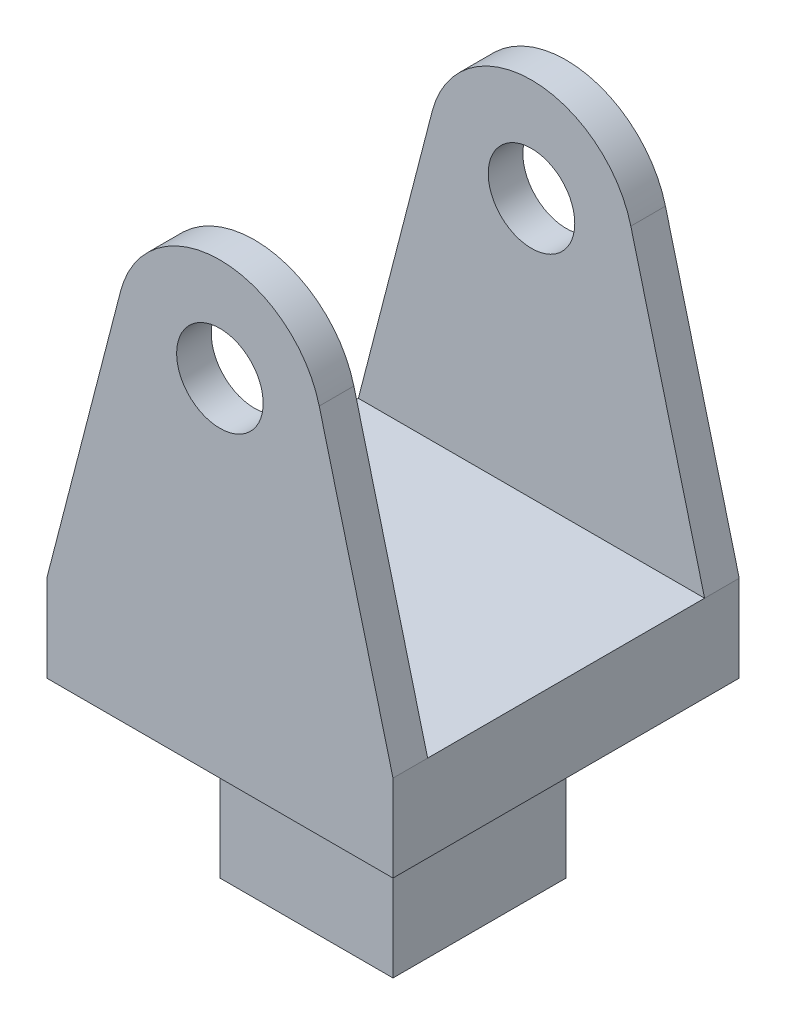
ISO-10303-21;
HEADER;
FILE_DESCRIPTION(('STEP AP214'),'2;1');
FILE_NAME('part.step','',(''),(''),'','','');
FILE_SCHEMA(('AUTOMOTIVE_DESIGN { 1 0 10303 214 1 1 1 1 }'));
ENDSEC;
DATA;
#1=APPLICATION_CONTEXT('core data for automotive mechanical design processes');
#2=APPLICATION_PROTOCOL_DEFINITION('international standard','automotive_design',2000,#1);
#3=PRODUCT_CONTEXT('',#1,'mechanical');
#4=PRODUCT('Part','Part','',(#3));
#5=PRODUCT_RELATED_PRODUCT_CATEGORY('part','',(#4));
#6=PRODUCT_DEFINITION_FORMATION('','',#4);
#7=PRODUCT_DEFINITION_CONTEXT('part definition',#1,'design');
#8=PRODUCT_DEFINITION('design','',#6,#7);
#9=PRODUCT_DEFINITION_SHAPE('','',#8);
#10=(LENGTH_UNIT() NAMED_UNIT(*) SI_UNIT(.MILLI.,.METRE.));
#11=(NAMED_UNIT(*) PLANE_ANGLE_UNIT() SI_UNIT($,.RADIAN.));
#12=(NAMED_UNIT(*) SI_UNIT($,.STERADIAN.) SOLID_ANGLE_UNIT());
#13=UNCERTAINTY_MEASURE_WITH_UNIT(LENGTH_MEASURE(1.E-05),#10,'distance_accuracy_value','');
#14=(GEOMETRIC_REPRESENTATION_CONTEXT(3) GLOBAL_UNCERTAINTY_ASSIGNED_CONTEXT((#13)) GLOBAL_UNIT_ASSIGNED_CONTEXT((#10,
#11,#12)) REPRESENTATION_CONTEXT('',''));
#15=CARTESIAN_POINT('',(0.,0.,0.));
#16=DIRECTION('',(0.,0.,1.));
#17=DIRECTION('',(1.,0.,0.));
#18=AXIS2_PLACEMENT_3D('',#15,#16,#17);
#19=CARTESIAN_POINT('',(0.,0.,0.));
#20=DIRECTION('',(0.,1.,0.));
#21=DIRECTION('',(0.,0.,1.));
#22=AXIS2_PLACEMENT_3D('',#19,#20,#21);
#23=PLANE('',#22);
#24=DIRECTION('',(0.,0.,-1.));
#25=VECTOR('',#24,1.);
#26=CARTESIAN_POINT('',(10.,0.,10.));
#27=LINE('',#26,#25);
#28=CARTESIAN_POINT('',(10.,0.,10.));
#29=VERTEX_POINT('',#28);
#30=CARTESIAN_POINT('',(10.,0.,-10.));
#31=VERTEX_POINT('',#30);
#32=EDGE_CURVE('E250',#29,#31,#27,.T.);
#33=ORIENTED_EDGE('',*,*,#32,.F.);
#34=DIRECTION('',(1.,0.,0.));
#35=VECTOR('',#34,1.);
#36=CARTESIAN_POINT('',(-10.,0.,10.));
#37=LINE('',#36,#35);
#38=CARTESIAN_POINT('',(-10.,0.,10.));
#39=VERTEX_POINT('',#38);
#40=EDGE_CURVE('E262',#39,#29,#37,.T.);
#41=ORIENTED_EDGE('',*,*,#40,.F.);
#42=DIRECTION('',(0.,0.,1.));
#43=VECTOR('',#42,1.);
#44=CARTESIAN_POINT('',(-10.,0.,-10.));
#45=LINE('',#44,#43);
#46=CARTESIAN_POINT('',(-10.,0.,-10.));
#47=VERTEX_POINT('',#46);
#48=EDGE_CURVE('E258',#47,#39,#45,.T.);
#49=ORIENTED_EDGE('',*,*,#48,.F.);
#50=DIRECTION('',(-1.,0.,0.));
#51=VECTOR('',#50,1.);
#52=CARTESIAN_POINT('',(10.,0.,-10.));
#53=LINE('',#52,#51);
#54=EDGE_CURVE('E254',#31,#47,#53,.T.);
#55=ORIENTED_EDGE('',*,*,#54,.F.);
#56=EDGE_LOOP('',(#33,#41,#49,#55));
#57=FACE_BOUND('',#56,.T.);
#58=DIRECTION('',(0.,0.,1.));
#59=VECTOR('',#58,1.);
#60=CARTESIAN_POINT('',(5.,0.,-5.));
#61=LINE('',#60,#59);
#62=CARTESIAN_POINT('',(5.,0.,-5.));
#63=VERTEX_POINT('',#62);
#64=CARTESIAN_POINT('',(5.,0.,5.));
#65=VERTEX_POINT('',#64);
#66=EDGE_CURVE('E160',#63,#65,#61,.T.);
#67=ORIENTED_EDGE('',*,*,#66,.F.);
#68=DIRECTION('',(1.,0.,0.));
#69=VECTOR('',#68,1.);
#70=CARTESIAN_POINT('',(-5.,0.,-5.));
#71=LINE('',#70,#69);
#72=CARTESIAN_POINT('',(-5.,0.,-5.));
#73=VERTEX_POINT('',#72);
#74=EDGE_CURVE('E157',#73,#63,#71,.T.);
#75=ORIENTED_EDGE('',*,*,#74,.F.);
#76=DIRECTION('',(0.,0.,-1.));
#77=VECTOR('',#76,1.);
#78=CARTESIAN_POINT('',(-5.,0.,5.));
#79=LINE('',#78,#77);
#80=CARTESIAN_POINT('',(-5.,0.,5.));
#81=VERTEX_POINT('',#80);
#82=EDGE_CURVE('E57',#81,#73,#79,.T.);
#83=ORIENTED_EDGE('',*,*,#82,.F.);
#84=DIRECTION('',(-1.,0.,0.));
#85=VECTOR('',#84,1.);
#86=CARTESIAN_POINT('',(5.,0.,5.));
#87=LINE('',#86,#85);
#88=EDGE_CURVE('E52',#65,#81,#87,.T.);
#89=ORIENTED_EDGE('',*,*,#88,.F.);
#90=EDGE_LOOP('',(#67,#75,#83,#89));
#91=FACE_BOUND('',#90,.T.);
#92=ADVANCED_FACE('F36',(#57,#91),#23,.F.);
#93=CARTESIAN_POINT('',(10.,30.,10.));
#94=DIRECTION('',(-1.,0.,0.));
#95=DIRECTION('',(0.,0.,1.));
#96=AXIS2_PLACEMENT_3D('',#93,#94,#95);
#97=PLANE('',#96);
#98=DIRECTION('',(0.,-1.,0.));
#99=VECTOR('',#98,1.);
#100=CARTESIAN_POINT('',(10.,30.,-10.));
#101=LINE('',#100,#99);
#102=CARTESIAN_POINT('',(10.,5.,-10.));
#103=VERTEX_POINT('',#102);
#104=EDGE_CURVE('E274',#103,#31,#101,.T.);
#105=ORIENTED_EDGE('',*,*,#104,.F.);
#106=DIRECTION('',(0.,0.,1.));
#107=VECTOR('',#106,1.);
#108=CARTESIAN_POINT('',(10.,5.,-23.));
#109=LINE('',#108,#107);
#110=CARTESIAN_POINT('',(10.,5.,-8.));
#111=VERTEX_POINT('',#110);
#112=EDGE_CURVE('E185',#103,#111,#109,.T.);
#113=ORIENTED_EDGE('',*,*,#112,.T.);
#114=DIRECTION('',(0.,0.,1.));
#115=VECTOR('',#114,1.);
#116=CARTESIAN_POINT('',(10.,5.,10.));
#117=LINE('',#116,#115);
#118=CARTESIAN_POINT('',(10.,5.,8.));
#119=VERTEX_POINT('',#118);
#120=EDGE_CURVE('E243',#111,#119,#117,.T.);
#121=ORIENTED_EDGE('',*,*,#120,.T.);
#122=CARTESIAN_POINT('',(10.,5.,10.));
#123=VERTEX_POINT('',#122);
#124=EDGE_CURVE('E181',#119,#123,#109,.T.);
#125=ORIENTED_EDGE('',*,*,#124,.T.);
#126=DIRECTION('',(0.,-1.,0.));
#127=VECTOR('',#126,1.);
#128=CARTESIAN_POINT('',(10.,30.,10.));
#129=LINE('',#128,#127);
#130=EDGE_CURVE('E266',#123,#29,#129,.T.);
#131=ORIENTED_EDGE('',*,*,#130,.T.);
#132=ORIENTED_EDGE('',*,*,#32,.T.);
#133=EDGE_LOOP('',(#105,#113,#121,#125,#131,#132));
#134=FACE_BOUND('',#133,.T.);
#135=ADVANCED_FACE('F38',(#134),#97,.F.);
#136=CARTESIAN_POINT('',(10.,30.,-10.));
#137=DIRECTION('',(0.,0.,1.));
#138=DIRECTION('',(1.,0.,0.));
#139=AXIS2_PLACEMENT_3D('',#136,#137,#138);
#140=PLANE('',#139);
#141=CARTESIAN_POINT('',(0.,20.,-10.));
#142=DIRECTION('',(0.,0.,1.));
#143=DIRECTION('',(1.,0.,0.));
#144=AXIS2_PLACEMENT_3D('',#141,#142,#143);
#145=CIRCLE('',#144,2.5);
#146=CARTESIAN_POINT('',(2.5,20.,-10.));
#147=VERTEX_POINT('',#146);
#148=EDGE_CURVE('E230',#147,#147,#145,.T.);
#149=ORIENTED_EDGE('',*,*,#148,.T.);
#150=EDGE_LOOP('',(#149));
#151=FACE_BOUND('',#150,.T.);
#152=CARTESIAN_POINT('',(0.,20.,-10.));
#153=DIRECTION('',(0.,0.,1.));
#154=DIRECTION('',(1.,0.,0.));
#155=AXIS2_PLACEMENT_3D('',#152,#153,#154);
#156=CIRCLE('',#155,5.92772311561762);
#157=CARTESIAN_POINT('',(-5.7390808161644,21.4835271217478,-10.));
#158=VERTEX_POINT('',#157);
#159=CARTESIAN_POINT('',(5.7390808161644,21.4835271217478,-10.));
#160=VERTEX_POINT('',#159);
#161=EDGE_CURVE('E209',#158,#160,#156,.F.);
#162=ORIENTED_EDGE('',*,*,#161,.T.);
#163=DIRECTION('',(0.250269301182297,-0.968176263335207,0.));
#164=VECTOR('',#163,1.);
#165=CARTESIAN_POINT('',(3.94238007884526,28.4341319221431,-10.));
#166=LINE('',#165,#164);
#167=EDGE_CURVE('E217',#160,#103,#166,.T.);
#168=ORIENTED_EDGE('',*,*,#167,.T.);
#169=ORIENTED_EDGE('',*,*,#104,.T.);
#170=ORIENTED_EDGE('',*,*,#54,.T.);
#171=DIRECTION('',(0.,-1.,0.));
#172=VECTOR('',#171,1.);
#173=CARTESIAN_POINT('',(-10.,30.,-10.));
#174=LINE('',#173,#172);
#175=CARTESIAN_POINT('',(-10.,5.,-10.));
#176=VERTEX_POINT('',#175);
#177=EDGE_CURVE('E271',#176,#47,#174,.T.);
#178=ORIENTED_EDGE('',*,*,#177,.F.);
#179=DIRECTION('',(0.250269301182297,0.968176263335207,0.));
#180=VECTOR('',#179,1.);
#181=CARTESIAN_POINT('',(-2.68968561655976,33.2802278590669,-10.));
#182=LINE('',#181,#180);
#183=EDGE_CURVE('E201',#176,#158,#182,.T.);
#184=ORIENTED_EDGE('',*,*,#183,.T.);
#185=EDGE_LOOP('',(#162,#168,#169,#170,#178,#184));
#186=FACE_BOUND('',#185,.T.);
#187=ADVANCED_FACE('F311',(#151,#186),#140,.F.);
#188=CARTESIAN_POINT('',(-10.,30.,-10.));
#189=DIRECTION('',(1.,0.,0.));
#190=DIRECTION('',(0.,0.,-1.));
#191=AXIS2_PLACEMENT_3D('',#188,#189,#190);
#192=PLANE('',#191);
#193=DIRECTION('',(0.,-1.,0.));
#194=VECTOR('',#193,1.);
#195=CARTESIAN_POINT('',(-10.,30.,10.));
#196=LINE('',#195,#194);
#197=CARTESIAN_POINT('',(-10.,5.,10.));
#198=VERTEX_POINT('',#197);
#199=EDGE_CURVE('E268',#198,#39,#196,.T.);
#200=ORIENTED_EDGE('',*,*,#199,.F.);
#201=DIRECTION('',(0.,0.,1.));
#202=VECTOR('',#201,1.);
#203=CARTESIAN_POINT('',(-10.,5.,-23.));
#204=LINE('',#203,#202);
#205=CARTESIAN_POINT('',(-10.,5.,8.));
#206=VERTEX_POINT('',#205);
#207=EDGE_CURVE('E180',#206,#198,#204,.T.);
#208=ORIENTED_EDGE('',*,*,#207,.F.);
#209=DIRECTION('',(0.,0.,1.));
#210=VECTOR('',#209,1.);
#211=CARTESIAN_POINT('',(-10.,5.,-8.));
#212=LINE('',#211,#210);
#213=CARTESIAN_POINT('',(-10.,5.,-8.));
#214=VERTEX_POINT('',#213);
#215=EDGE_CURVE('E234',#214,#206,#212,.T.);
#216=ORIENTED_EDGE('',*,*,#215,.F.);
#217=EDGE_CURVE('E194',#176,#214,#204,.T.);
#218=ORIENTED_EDGE('',*,*,#217,.F.);
#219=ORIENTED_EDGE('',*,*,#177,.T.);
#220=ORIENTED_EDGE('',*,*,#48,.T.);
#221=EDGE_LOOP('',(#200,#208,#216,#218,#219,#220));
#222=FACE_BOUND('',#221,.T.);
#223=ADVANCED_FACE('F358',(#222),#192,.F.);
#224=CARTESIAN_POINT('',(-10.,30.,10.));
#225=DIRECTION('',(0.,0.,-1.));
#226=DIRECTION('',(-1.,0.,0.));
#227=AXIS2_PLACEMENT_3D('',#224,#225,#226);
#228=PLANE('',#227);
#229=CARTESIAN_POINT('',(0.,20.,10.));
#230=DIRECTION('',(0.,0.,-1.));
#231=DIRECTION('',(-1.,0.,0.));
#232=AXIS2_PLACEMENT_3D('',#229,#230,#231);
#233=CIRCLE('',#232,2.5);
#234=CARTESIAN_POINT('',(-2.5,20.,10.));
#235=VERTEX_POINT('',#234);
#236=EDGE_CURVE('E226',#235,#235,#233,.T.);
#237=ORIENTED_EDGE('',*,*,#236,.T.);
#238=EDGE_LOOP('',(#237));
#239=FACE_BOUND('',#238,.T.);
#240=ORIENTED_EDGE('',*,*,#130,.F.);
#241=DIRECTION('',(0.250269301182297,-0.968176263335207,0.));
#242=VECTOR('',#241,1.);
#243=CARTESIAN_POINT('',(10.,5.,10.));
#244=LINE('',#243,#242);
#245=CARTESIAN_POINT('',(5.7390808161644,21.4835271217478,10.));
#246=VERTEX_POINT('',#245);
#247=EDGE_CURVE('E177',#246,#123,#244,.T.);
#248=ORIENTED_EDGE('',*,*,#247,.F.);
#249=CARTESIAN_POINT('',(0.,20.,10.));
#250=DIRECTION('',(0.,0.,-1.));
#251=DIRECTION('',(1.,0.,0.));
#252=AXIS2_PLACEMENT_3D('',#249,#250,#251);
#253=CIRCLE('',#252,5.92772311561762);
#254=CARTESIAN_POINT('',(-5.7390808161644,21.4835271217478,10.));
#255=VERTEX_POINT('',#254);
#256=EDGE_CURVE('E167',#255,#246,#253,.T.);
#257=ORIENTED_EDGE('',*,*,#256,.F.);
#258=DIRECTION('',(0.250269301182297,0.968176263335208,0.));
#259=VECTOR('',#258,1.);
#260=CARTESIAN_POINT('',(-10.,5.,10.));
#261=LINE('',#260,#259);
#262=EDGE_CURVE('E162',#198,#255,#261,.T.);
#263=ORIENTED_EDGE('',*,*,#262,.F.);
#264=ORIENTED_EDGE('',*,*,#199,.T.);
#265=ORIENTED_EDGE('',*,*,#40,.T.);
#266=EDGE_LOOP('',(#240,#248,#257,#263,#264,#265));
#267=FACE_BOUND('',#266,.T.);
#268=ADVANCED_FACE('F302',(#239,#267),#228,.F.);
#269=CARTESIAN_POINT('',(16.,5.,-8.));
#270=DIRECTION('',(0.,-1.,0.));
#271=DIRECTION('',(0.,0.,-1.));
#272=AXIS2_PLACEMENT_3D('',#269,#270,#271);
#273=PLANE('',#272);
#274=DIRECTION('',(-1.,0.,0.));
#275=VECTOR('',#274,1.);
#276=CARTESIAN_POINT('',(16.,5.,-8.));
#277=LINE('',#276,#275);
#278=EDGE_CURVE('E238',#111,#214,#277,.T.);
#279=ORIENTED_EDGE('',*,*,#278,.T.);
#280=ORIENTED_EDGE('',*,*,#215,.T.);
#281=DIRECTION('',(-1.,0.,0.));
#282=VECTOR('',#281,1.);
#283=CARTESIAN_POINT('',(16.,5.,8.));
#284=LINE('',#283,#282);
#285=EDGE_CURVE('E239',#119,#206,#284,.T.);
#286=ORIENTED_EDGE('',*,*,#285,.F.);
#287=ORIENTED_EDGE('',*,*,#120,.F.);
#288=EDGE_LOOP('',(#279,#280,#286,#287));
#289=FACE_BOUND('',#288,.T.);
#290=ADVANCED_FACE('F354',(#289),#273,.F.);
#291=CARTESIAN_POINT('',(16.,30.,-8.));
#292=DIRECTION('',(0.,0.,-1.));
#293=DIRECTION('',(0.,1.,0.));
#294=AXIS2_PLACEMENT_3D('',#291,#292,#293);
#295=PLANE('',#294);
#296=CARTESIAN_POINT('',(0.,20.,-8.));
#297=DIRECTION('',(0.,0.,-1.));
#298=DIRECTION('',(0.,1.,0.));
#299=AXIS2_PLACEMENT_3D('',#296,#297,#298);
#300=CIRCLE('',#299,2.5);
#301=CARTESIAN_POINT('',(0.,22.5,-8.));
#302=VERTEX_POINT('',#301);
#303=EDGE_CURVE('E222',#302,#302,#300,.T.);
#304=ORIENTED_EDGE('',*,*,#303,.T.);
#305=EDGE_LOOP('',(#304));
#306=FACE_BOUND('',#305,.T.);
#307=ORIENTED_EDGE('',*,*,#278,.F.);
#308=DIRECTION('',(-0.250269301182297,0.968176263335207,0.));
#309=VECTOR('',#308,1.);
#310=CARTESIAN_POINT('',(4.31818841753091,26.980303141066,-8.));
#311=LINE('',#310,#309);
#312=CARTESIAN_POINT('',(5.7390808161644,21.4835271217478,-8.));
#313=VERTEX_POINT('',#312);
#314=EDGE_CURVE('E213',#111,#313,#311,.T.);
#315=ORIENTED_EDGE('',*,*,#314,.T.);
#316=CARTESIAN_POINT('',(0.,20.,-8.));
#317=DIRECTION('',(0.,0.,-1.));
#318=DIRECTION('',(0.,1.,0.));
#319=AXIS2_PLACEMENT_3D('',#316,#317,#318);
#320=CIRCLE('',#319,5.92772311561762);
#321=CARTESIAN_POINT('',(-5.7390808161644,21.4835271217478,-8.));
#322=VERTEX_POINT('',#321);
#323=EDGE_CURVE('E205',#313,#322,#320,.F.);
#324=ORIENTED_EDGE('',*,*,#323,.T.);
#325=DIRECTION('',(-0.250269301182297,-0.968176263335207,0.));
#326=VECTOR('',#325,1.);
#327=CARTESIAN_POINT('',(-2.31387727787411,34.734056640144,-8.));
#328=LINE('',#327,#326);
#329=EDGE_CURVE('E197',#322,#214,#328,.T.);
#330=ORIENTED_EDGE('',*,*,#329,.T.);
#331=EDGE_LOOP('',(#307,#315,#324,#330));
#332=FACE_BOUND('',#331,.T.);
#333=ADVANCED_FACE('F351',(#306,#332),#295,.F.);
#334=CARTESIAN_POINT('',(16.,30.,8.));
#335=DIRECTION('',(0.,0.,1.));
#336=DIRECTION('',(0.,-1.,0.));
#337=AXIS2_PLACEMENT_3D('',#334,#335,#336);
#338=PLANE('',#337);
#339=CARTESIAN_POINT('',(0.,20.,8.));
#340=DIRECTION('',(0.,0.,1.));
#341=DIRECTION('',(0.,-1.,0.));
#342=AXIS2_PLACEMENT_3D('',#339,#340,#341);
#343=CIRCLE('',#342,2.5);
#344=CARTESIAN_POINT('',(0.,17.5,8.));
#345=VERTEX_POINT('',#344);
#346=EDGE_CURVE('E221',#345,#345,#343,.T.);
#347=ORIENTED_EDGE('',*,*,#346,.T.);
#348=EDGE_LOOP('',(#347));
#349=FACE_BOUND('',#348,.T.);
#350=CARTESIAN_POINT('',(0.,20.,8.));
#351=DIRECTION('',(0.,0.,1.));
#352=DIRECTION('',(0.,-1.,0.));
#353=AXIS2_PLACEMENT_3D('',#350,#351,#352);
#354=CIRCLE('',#353,5.92772311561762);
#355=CARTESIAN_POINT('',(-5.7390808161644,21.4835271217478,8.));
#356=VERTEX_POINT('',#355);
#357=CARTESIAN_POINT('',(5.7390808161644,21.4835271217478,8.));
#358=VERTEX_POINT('',#357);
#359=EDGE_CURVE('E45',#356,#358,#354,.F.);
#360=ORIENTED_EDGE('',*,*,#359,.T.);
#361=DIRECTION('',(0.250269301182297,-0.968176263335207,0.));
#362=VECTOR('',#361,1.);
#363=CARTESIAN_POINT('',(4.31818841753091,26.980303141066,8.));
#364=LINE('',#363,#362);
#365=EDGE_CURVE('E11',#358,#119,#364,.T.);
#366=ORIENTED_EDGE('',*,*,#365,.T.);
#367=ORIENTED_EDGE('',*,*,#285,.T.);
#368=DIRECTION('',(0.250269301182297,0.968176263335207,0.));
#369=VECTOR('',#368,1.);
#370=CARTESIAN_POINT('',(-2.31387727787411,34.734056640144,8.));
#371=LINE('',#370,#369);
#372=EDGE_CURVE('E277',#206,#356,#371,.T.);
#373=ORIENTED_EDGE('',*,*,#372,.T.);
#374=EDGE_LOOP('',(#360,#366,#367,#373));
#375=FACE_BOUND('',#374,.T.);
#376=ADVANCED_FACE('F287',(#349,#375),#338,.F.);
#377=CARTESIAN_POINT('',(0.,20.,-16.5));
#378=DIRECTION('',(0.,0.,1.));
#379=DIRECTION('',(1.,0.,0.));
#380=AXIS2_PLACEMENT_3D('',#377,#378,#379);
#381=CYLINDRICAL_SURFACE('',#380,2.5);
#382=ORIENTED_EDGE('',*,*,#346,.F.);
#383=EDGE_LOOP('',(#382));
#384=FACE_BOUND('',#383,.T.);
#385=ORIENTED_EDGE('',*,*,#236,.F.);
#386=EDGE_LOOP('',(#385));
#387=FACE_BOUND('',#386,.T.);
#388=ADVANCED_FACE('F370',(#384,#387),#381,.F.);
#389=ORIENTED_EDGE('',*,*,#303,.F.);
#390=EDGE_LOOP('',(#389));
#391=FACE_BOUND('',#390,.T.);
#392=ORIENTED_EDGE('',*,*,#148,.F.);
#393=EDGE_LOOP('',(#392));
#394=FACE_BOUND('',#393,.T.);
#395=ADVANCED_FACE('F362',(#391,#394),#381,.F.);
#396=CARTESIAN_POINT('',(-10.,5.,-23.));
#397=DIRECTION('',(0.968176263335207,-0.250269301182297,0.));
#398=DIRECTION('',(0.250269301182297,0.968176263335207,0.));
#399=AXIS2_PLACEMENT_3D('',#396,#397,#398);
#400=PLANE('',#399);
#401=ORIENTED_EDGE('',*,*,#207,.T.);
#402=ORIENTED_EDGE('',*,*,#262,.T.);
#403=DIRECTION('',(0.,0.,1.));
#404=VECTOR('',#403,1.);
#405=CARTESIAN_POINT('',(-5.7390808161644,21.4835271217478,-23.));
#406=LINE('',#405,#404);
#407=EDGE_CURVE('E191',#356,#255,#406,.T.);
#408=ORIENTED_EDGE('',*,*,#407,.F.);
#409=ORIENTED_EDGE('',*,*,#372,.F.);
#410=EDGE_LOOP('',(#401,#402,#408,#409));
#411=FACE_BOUND('',#410,.T.);
#412=ADVANCED_FACE('F360',(#411),#400,.F.);
#413=CARTESIAN_POINT('',(0.,20.,-23.));
#414=DIRECTION('',(0.,0.,1.));
#415=DIRECTION('',(1.,0.,0.));
#416=AXIS2_PLACEMENT_3D('',#413,#414,#415);
#417=CYLINDRICAL_SURFACE('',#416,5.92772311561762);
#418=ORIENTED_EDGE('',*,*,#407,.T.);
#419=ORIENTED_EDGE('',*,*,#256,.T.);
#420=DIRECTION('',(0.,0.,1.));
#421=VECTOR('',#420,1.);
#422=CARTESIAN_POINT('',(5.7390808161644,21.4835271217478,-23.));
#423=LINE('',#422,#421);
#424=EDGE_CURVE('E187',#358,#246,#423,.T.);
#425=ORIENTED_EDGE('',*,*,#424,.F.);
#426=ORIENTED_EDGE('',*,*,#359,.F.);
#427=EDGE_LOOP('',(#418,#419,#425,#426));
#428=FACE_BOUND('',#427,.T.);
#429=ADVANCED_FACE('F291',(#428),#417,.T.);
#430=CARTESIAN_POINT('',(10.,5.,-23.));
#431=DIRECTION('',(-0.968176263335207,-0.250269301182297,0.));
#432=DIRECTION('',(0.250269301182297,-0.968176263335207,0.));
#433=AXIS2_PLACEMENT_3D('',#430,#431,#432);
#434=PLANE('',#433);
#435=ORIENTED_EDGE('',*,*,#424,.T.);
#436=ORIENTED_EDGE('',*,*,#247,.T.);
#437=ORIENTED_EDGE('',*,*,#124,.F.);
#438=ORIENTED_EDGE('',*,*,#365,.F.);
#439=EDGE_LOOP('',(#435,#436,#437,#438));
#440=FACE_BOUND('',#439,.T.);
#441=ADVANCED_FACE('F295',(#440),#434,.F.);
#442=EDGE_CURVE('E186',#160,#313,#423,.T.);
#443=ORIENTED_EDGE('',*,*,#442,.T.);
#444=ORIENTED_EDGE('',*,*,#314,.F.);
#445=ORIENTED_EDGE('',*,*,#112,.F.);
#446=ORIENTED_EDGE('',*,*,#167,.F.);
#447=EDGE_LOOP('',(#443,#444,#445,#446));
#448=FACE_BOUND('',#447,.T.);
#449=ADVANCED_FACE('F316',(#448),#434,.F.);
#450=EDGE_CURVE('E190',#158,#322,#406,.T.);
#451=ORIENTED_EDGE('',*,*,#450,.T.);
#452=ORIENTED_EDGE('',*,*,#323,.F.);
#453=ORIENTED_EDGE('',*,*,#442,.F.);
#454=ORIENTED_EDGE('',*,*,#161,.F.);
#455=EDGE_LOOP('',(#451,#452,#453,#454));
#456=FACE_BOUND('',#455,.T.);
#457=ADVANCED_FACE('F319',(#456),#417,.T.);
#458=ORIENTED_EDGE('',*,*,#217,.T.);
#459=ORIENTED_EDGE('',*,*,#329,.F.);
#460=ORIENTED_EDGE('',*,*,#450,.F.);
#461=ORIENTED_EDGE('',*,*,#183,.F.);
#462=EDGE_LOOP('',(#458,#459,#460,#461));
#463=FACE_BOUND('',#462,.T.);
#464=ADVANCED_FACE('F364',(#463),#400,.F.);
#465=CARTESIAN_POINT('',(5.,-10.,-5.));
#466=DIRECTION('',(-1.,0.,0.));
#467=DIRECTION('',(0.,0.,1.));
#468=AXIS2_PLACEMENT_3D('',#465,#466,#467);
#469=PLANE('',#468);
#470=ORIENTED_EDGE('',*,*,#66,.T.);
#471=DIRECTION('',(0.,1.,0.));
#472=VECTOR('',#471,1.);
#473=CARTESIAN_POINT('',(5.,-10.,5.));
#474=LINE('',#473,#472);
#475=CARTESIAN_POINT('',(5.,-10.,5.));
#476=VERTEX_POINT('',#475);
#477=EDGE_CURVE('E139',#476,#65,#474,.T.);
#478=ORIENTED_EDGE('',*,*,#477,.F.);
#479=DIRECTION('',(0.,0.,1.));
#480=VECTOR('',#479,1.);
#481=CARTESIAN_POINT('',(5.,-10.,-5.));
#482=LINE('',#481,#480);
#483=CARTESIAN_POINT('',(5.,-10.,-5.));
#484=VERTEX_POINT('',#483);
#485=EDGE_CURVE('E147',#484,#476,#482,.T.);
#486=ORIENTED_EDGE('',*,*,#485,.F.);
#487=DIRECTION('',(0.,1.,0.));
#488=VECTOR('',#487,1.);
#489=CARTESIAN_POINT('',(5.,-10.,-5.));
#490=LINE('',#489,#488);
#491=EDGE_CURVE('E324',#484,#63,#490,.T.);
#492=ORIENTED_EDGE('',*,*,#491,.T.);
#493=EDGE_LOOP('',(#470,#478,#486,#492));
#494=FACE_BOUND('',#493,.T.);
#495=ADVANCED_FACE('F159',(#494),#469,.F.);
#496=CARTESIAN_POINT('',(5.,-10.,5.));
#497=DIRECTION('',(0.,0.,-1.));
#498=DIRECTION('',(-1.,0.,0.));
#499=AXIS2_PLACEMENT_3D('',#496,#497,#498);
#500=PLANE('',#499);
#501=ORIENTED_EDGE('',*,*,#88,.T.);
#502=DIRECTION('',(0.,1.,0.));
#503=VECTOR('',#502,1.);
#504=CARTESIAN_POINT('',(-5.,-10.,5.));
#505=LINE('',#504,#503);
#506=CARTESIAN_POINT('',(-5.,-10.,5.));
#507=VERTEX_POINT('',#506);
#508=EDGE_CURVE('E142',#507,#81,#505,.T.);
#509=ORIENTED_EDGE('',*,*,#508,.F.);
#510=DIRECTION('',(-1.,0.,0.));
#511=VECTOR('',#510,1.);
#512=CARTESIAN_POINT('',(5.,-10.,5.));
#513=LINE('',#512,#511);
#514=EDGE_CURVE('E135',#476,#507,#513,.T.);
#515=ORIENTED_EDGE('',*,*,#514,.F.);
#516=ORIENTED_EDGE('',*,*,#477,.T.);
#517=EDGE_LOOP('',(#501,#509,#515,#516));
#518=FACE_BOUND('',#517,.T.);
#519=ADVANCED_FACE('F137',(#518),#500,.F.);
#520=CARTESIAN_POINT('',(-5.,-10.,5.));
#521=DIRECTION('',(1.,0.,0.));
#522=DIRECTION('',(0.,0.,-1.));
#523=AXIS2_PLACEMENT_3D('',#520,#521,#522);
#524=PLANE('',#523);
#525=ORIENTED_EDGE('',*,*,#82,.T.);
#526=DIRECTION('',(0.,1.,0.));
#527=VECTOR('',#526,1.);
#528=CARTESIAN_POINT('',(-5.,-10.,-5.));
#529=LINE('',#528,#527);
#530=CARTESIAN_POINT('',(-5.,-10.,-5.));
#531=VERTEX_POINT('',#530);
#532=EDGE_CURVE('E170',#531,#73,#529,.T.);
#533=ORIENTED_EDGE('',*,*,#532,.F.);
#534=DIRECTION('',(0.,0.,-1.));
#535=VECTOR('',#534,1.);
#536=CARTESIAN_POINT('',(-5.,-10.,5.));
#537=LINE('',#536,#535);
#538=EDGE_CURVE('E146',#507,#531,#537,.T.);
#539=ORIENTED_EDGE('',*,*,#538,.F.);
#540=ORIENTED_EDGE('',*,*,#508,.T.);
#541=EDGE_LOOP('',(#525,#533,#539,#540));
#542=FACE_BOUND('',#541,.T.);
#543=ADVANCED_FACE('F339',(#542),#524,.F.);
#544=CARTESIAN_POINT('',(-5.,-10.,-5.));
#545=DIRECTION('',(0.,0.,1.));
#546=DIRECTION('',(1.,0.,0.));
#547=AXIS2_PLACEMENT_3D('',#544,#545,#546);
#548=PLANE('',#547);
#549=ORIENTED_EDGE('',*,*,#74,.T.);
#550=ORIENTED_EDGE('',*,*,#491,.F.);
#551=DIRECTION('',(1.,0.,0.));
#552=VECTOR('',#551,1.);
#553=CARTESIAN_POINT('',(-5.,-10.,-5.));
#554=LINE('',#553,#552);
#555=EDGE_CURVE('E152',#531,#484,#554,.T.);
#556=ORIENTED_EDGE('',*,*,#555,.F.);
#557=ORIENTED_EDGE('',*,*,#532,.T.);
#558=EDGE_LOOP('',(#549,#550,#556,#557));
#559=FACE_BOUND('',#558,.T.);
#560=ADVANCED_FACE('F337',(#559),#548,.F.);
#561=CARTESIAN_POINT('',(0.,-10.,0.));
#562=DIRECTION('',(0.,-1.,0.));
#563=DIRECTION('',(0.,0.,-1.));
#564=AXIS2_PLACEMENT_3D('',#561,#562,#563);
#565=PLANE('',#564);
#566=ORIENTED_EDGE('',*,*,#485,.T.);
#567=ORIENTED_EDGE('',*,*,#514,.T.);
#568=ORIENTED_EDGE('',*,*,#538,.T.);
#569=ORIENTED_EDGE('',*,*,#555,.T.);
#570=EDGE_LOOP('',(#566,#567,#568,#569));
#571=FACE_BOUND('',#570,.T.);
#572=ADVANCED_FACE('F150',(#571),#565,.T.);
#573=CLOSED_SHELL('',(#92,#135,#187,#223,#268,#290,#333,#376,#388,#395,#412,#429,#441,#449,#457,
#464,#495,#519,#543,#560,#572));
#574=MANIFOLD_SOLID_BREP('B2',#573);
#575=ADVANCED_BREP_SHAPE_REPRESENTATION('',(#18,#574),#14);
#576=SHAPE_DEFINITION_REPRESENTATION(#9,#575);
ENDSEC;
END-ISO-10303-21;
